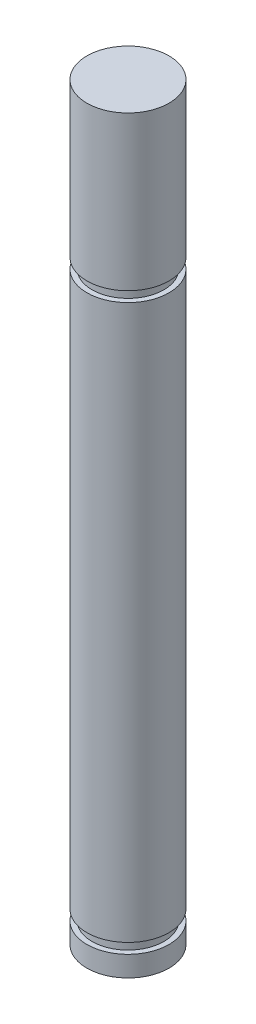
ISO-10303-21;
HEADER;
FILE_DESCRIPTION(('STEP AP214'),'2;1');
FILE_NAME('part.step','',(''),(''),'','','');
FILE_SCHEMA(('AUTOMOTIVE_DESIGN { 1 0 10303 214 1 1 1 1 }'));
ENDSEC;
DATA;
#1=APPLICATION_CONTEXT('core data for automotive mechanical design processes');
#2=APPLICATION_PROTOCOL_DEFINITION('international standard','automotive_design',2000,#1);
#3=PRODUCT_CONTEXT('',#1,'mechanical');
#4=PRODUCT('Part','Part','',(#3));
#5=PRODUCT_RELATED_PRODUCT_CATEGORY('part','',(#4));
#6=PRODUCT_DEFINITION_FORMATION('','',#4);
#7=PRODUCT_DEFINITION_CONTEXT('part definition',#1,'design');
#8=PRODUCT_DEFINITION('design','',#6,#7);
#9=PRODUCT_DEFINITION_SHAPE('','',#8);
#10=(LENGTH_UNIT() NAMED_UNIT(*) SI_UNIT(.MILLI.,.METRE.));
#11=(NAMED_UNIT(*) PLANE_ANGLE_UNIT() SI_UNIT($,.RADIAN.));
#12=(NAMED_UNIT(*) SI_UNIT($,.STERADIAN.) SOLID_ANGLE_UNIT());
#13=UNCERTAINTY_MEASURE_WITH_UNIT(LENGTH_MEASURE(1.E-05),#10,'distance_accuracy_value','');
#14=(GEOMETRIC_REPRESENTATION_CONTEXT(3) GLOBAL_UNCERTAINTY_ASSIGNED_CONTEXT((#13)) GLOBAL_UNIT_ASSIGNED_CONTEXT((#10,
#11,#12)) REPRESENTATION_CONTEXT('',''));
#15=CARTESIAN_POINT('',(0.,0.,0.));
#16=DIRECTION('',(0.,0.,1.));
#17=DIRECTION('',(1.,0.,0.));
#18=AXIS2_PLACEMENT_3D('',#15,#16,#17);
#19=CARTESIAN_POINT('',(0.,73.,0.));
#20=DIRECTION('',(0.,-1.,0.));
#21=DIRECTION('',(0.,0.,-1.));
#22=AXIS2_PLACEMENT_3D('',#19,#20,#21);
#23=CYLINDRICAL_SURFACE('',#22,4.);
#24=CARTESIAN_POINT('',(0.,58.,0.));
#25=DIRECTION('',(0.,1.,0.));
#26=DIRECTION('',(0.,0.,1.));
#27=AXIS2_PLACEMENT_3D('',#24,#25,#26);
#28=CIRCLE('',#27,4.);
#29=CARTESIAN_POINT('',(0.,58.,4.));
#30=VERTEX_POINT('',#29);
#31=EDGE_CURVE('E56',#30,#30,#28,.T.);
#32=ORIENTED_EDGE('',*,*,#31,.T.);
#33=EDGE_LOOP('',(#32));
#34=FACE_BOUND('',#33,.T.);
#35=CARTESIAN_POINT('',(0.,73.,0.));
#36=DIRECTION('',(0.,1.,0.));
#37=DIRECTION('',(0.,0.,1.));
#38=AXIS2_PLACEMENT_3D('',#35,#36,#37);
#39=CIRCLE('',#38,4.);
#40=CARTESIAN_POINT('',(0.,73.,4.));
#41=VERTEX_POINT('',#40);
#42=EDGE_CURVE('E10',#41,#41,#39,.T.);
#43=ORIENTED_EDGE('',*,*,#42,.F.);
#44=EDGE_LOOP('',(#43));
#45=FACE_BOUND('',#44,.T.);
#46=ADVANCED_FACE('F43',(#34,#45),#23,.T.);
#47=CARTESIAN_POINT('',(0.,73.,0.));
#48=DIRECTION('',(0.,1.,0.));
#49=DIRECTION('',(0.,0.,1.));
#50=AXIS2_PLACEMENT_3D('',#47,#48,#49);
#51=PLANE('',#50);
#52=ORIENTED_EDGE('',*,*,#42,.T.);
#53=EDGE_LOOP('',(#52));
#54=FACE_BOUND('',#53,.T.);
#55=ADVANCED_FACE('F138',(#54),#51,.T.);
#56=CARTESIAN_POINT('',(-3.5,58.,0.));
#57=DIRECTION('',(0.,1.,0.));
#58=DIRECTION('',(0.,0.,1.));
#59=AXIS2_PLACEMENT_3D('',#56,#57,#58);
#60=PLANE('',#59);
#61=ORIENTED_EDGE('',*,*,#31,.F.);
#62=EDGE_LOOP('',(#61));
#63=FACE_BOUND('',#62,.T.);
#64=CARTESIAN_POINT('',(0.,58.,0.));
#65=DIRECTION('',(0.,1.,0.));
#66=DIRECTION('',(0.,0.,1.));
#67=AXIS2_PLACEMENT_3D('',#64,#65,#66);
#68=CIRCLE('',#67,3.5);
#69=CARTESIAN_POINT('',(0.,58.,3.5));
#70=VERTEX_POINT('',#69);
#71=EDGE_CURVE('E62',#70,#70,#68,.T.);
#72=ORIENTED_EDGE('',*,*,#71,.T.);
#73=EDGE_LOOP('',(#72));
#74=FACE_BOUND('',#73,.T.);
#75=ADVANCED_FACE('F90',(#63,#74),#60,.F.);
#76=CARTESIAN_POINT('',(-4.,57.,0.));
#77=DIRECTION('',(0.,-1.,0.));
#78=DIRECTION('',(0.,0.,-1.));
#79=AXIS2_PLACEMENT_3D('',#76,#77,#78);
#80=PLANE('',#79);
#81=CARTESIAN_POINT('',(0.,57.,0.));
#82=DIRECTION('',(0.,1.,0.));
#83=DIRECTION('',(0.,0.,1.));
#84=AXIS2_PLACEMENT_3D('',#81,#82,#83);
#85=CIRCLE('',#84,3.5);
#86=CARTESIAN_POINT('',(0.,57.,3.5));
#87=VERTEX_POINT('',#86);
#88=EDGE_CURVE('E82',#87,#87,#85,.T.);
#89=ORIENTED_EDGE('',*,*,#88,.F.);
#90=EDGE_LOOP('',(#89));
#91=FACE_BOUND('',#90,.T.);
#92=CARTESIAN_POINT('',(0.,57.,0.));
#93=DIRECTION('',(0.,1.,0.));
#94=DIRECTION('',(0.,0.,1.));
#95=AXIS2_PLACEMENT_3D('',#92,#93,#94);
#96=CIRCLE('',#95,4.);
#97=CARTESIAN_POINT('',(0.,57.,4.));
#98=VERTEX_POINT('',#97);
#99=EDGE_CURVE('E78',#98,#98,#96,.T.);
#100=ORIENTED_EDGE('',*,*,#99,.T.);
#101=EDGE_LOOP('',(#100));
#102=FACE_BOUND('',#101,.T.);
#103=ADVANCED_FACE('F95',(#91,#102),#80,.F.);
#104=CARTESIAN_POINT('',(0.,73.,0.));
#105=DIRECTION('',(0.,1.,0.));
#106=DIRECTION('',(0.,0.,1.));
#107=AXIS2_PLACEMENT_3D('',#104,#105,#106);
#108=CYLINDRICAL_SURFACE('',#107,3.5);
#109=ORIENTED_EDGE('',*,*,#71,.F.);
#110=EDGE_LOOP('',(#109));
#111=FACE_BOUND('',#110,.T.);
#112=ORIENTED_EDGE('',*,*,#88,.T.);
#113=EDGE_LOOP('',(#112));
#114=FACE_BOUND('',#113,.T.);
#115=ADVANCED_FACE('F92',(#111,#114),#108,.T.);
#116=ORIENTED_EDGE('',*,*,#99,.F.);
#117=EDGE_LOOP('',(#116));
#118=FACE_BOUND('',#117,.T.);
#119=CARTESIAN_POINT('',(0.,3.,0.));
#120=DIRECTION('',(0.,1.,0.));
#121=DIRECTION('',(0.,0.,1.));
#122=AXIS2_PLACEMENT_3D('',#119,#120,#121);
#123=CIRCLE('',#122,4.);
#124=CARTESIAN_POINT('',(0.,3.,4.));
#125=VERTEX_POINT('',#124);
#126=EDGE_CURVE('E63',#125,#125,#123,.T.);
#127=ORIENTED_EDGE('',*,*,#126,.T.);
#128=EDGE_LOOP('',(#127));
#129=FACE_BOUND('',#128,.T.);
#130=ADVANCED_FACE('F45',(#118,#129),#23,.T.);
#131=CARTESIAN_POINT('',(-3.5,2.,0.));
#132=DIRECTION('',(0.,-1.,0.));
#133=DIRECTION('',(0.,0.,-1.));
#134=AXIS2_PLACEMENT_3D('',#131,#132,#133);
#135=PLANE('',#134);
#136=CARTESIAN_POINT('',(0.,2.,0.));
#137=DIRECTION('',(0.,1.,0.));
#138=DIRECTION('',(0.,0.,1.));
#139=AXIS2_PLACEMENT_3D('',#136,#137,#138);
#140=CIRCLE('',#139,3.5);
#141=CARTESIAN_POINT('',(0.,2.,3.5));
#142=VERTEX_POINT('',#141);
#143=EDGE_CURVE('E71',#142,#142,#140,.T.);
#144=ORIENTED_EDGE('',*,*,#143,.F.);
#145=EDGE_LOOP('',(#144));
#146=FACE_BOUND('',#145,.T.);
#147=CARTESIAN_POINT('',(0.,2.,0.));
#148=DIRECTION('',(0.,1.,0.));
#149=DIRECTION('',(0.,0.,1.));
#150=AXIS2_PLACEMENT_3D('',#147,#148,#149);
#151=CIRCLE('',#150,4.);
#152=CARTESIAN_POINT('',(0.,2.,4.));
#153=VERTEX_POINT('',#152);
#154=EDGE_CURVE('E58',#153,#153,#151,.T.);
#155=ORIENTED_EDGE('',*,*,#154,.T.);
#156=EDGE_LOOP('',(#155));
#157=FACE_BOUND('',#156,.T.);
#158=ADVANCED_FACE('F106',(#146,#157),#135,.F.);
#159=CARTESIAN_POINT('',(-4.,3.,0.));
#160=DIRECTION('',(0.,1.,0.));
#161=DIRECTION('',(0.,0.,1.));
#162=AXIS2_PLACEMENT_3D('',#159,#160,#161);
#163=PLANE('',#162);
#164=ORIENTED_EDGE('',*,*,#126,.F.);
#165=EDGE_LOOP('',(#164));
#166=FACE_BOUND('',#165,.T.);
#167=CARTESIAN_POINT('',(0.,3.,0.));
#168=DIRECTION('',(0.,1.,0.));
#169=DIRECTION('',(0.,0.,1.));
#170=AXIS2_PLACEMENT_3D('',#167,#168,#169);
#171=CIRCLE('',#170,3.5);
#172=CARTESIAN_POINT('',(0.,3.,3.5));
#173=VERTEX_POINT('',#172);
#174=EDGE_CURVE('E67',#173,#173,#171,.T.);
#175=ORIENTED_EDGE('',*,*,#174,.T.);
#176=EDGE_LOOP('',(#175));
#177=FACE_BOUND('',#176,.T.);
#178=ADVANCED_FACE('F110',(#166,#177),#163,.F.);
#179=CARTESIAN_POINT('',(0.,73.,0.));
#180=DIRECTION('',(0.,1.,0.));
#181=DIRECTION('',(0.,0.,1.));
#182=AXIS2_PLACEMENT_3D('',#179,#180,#181);
#183=CYLINDRICAL_SURFACE('',#182,3.5);
#184=ORIENTED_EDGE('',*,*,#174,.F.);
#185=EDGE_LOOP('',(#184));
#186=FACE_BOUND('',#185,.T.);
#187=ORIENTED_EDGE('',*,*,#143,.T.);
#188=EDGE_LOOP('',(#187));
#189=FACE_BOUND('',#188,.T.);
#190=ADVANCED_FACE('F113',(#186,#189),#183,.T.);
#191=CARTESIAN_POINT('',(0.,0.,0.));
#192=DIRECTION('',(0.,1.,0.));
#193=DIRECTION('',(0.,0.,1.));
#194=AXIS2_PLACEMENT_3D('',#191,#192,#193);
#195=PLANE('',#194);
#196=CARTESIAN_POINT('',(0.,0.,0.));
#197=DIRECTION('',(0.,1.,0.));
#198=DIRECTION('',(0.,0.,1.));
#199=AXIS2_PLACEMENT_3D('',#196,#197,#198);
#200=CIRCLE('',#199,4.);
#201=CARTESIAN_POINT('',(0.,0.,4.));
#202=VERTEX_POINT('',#201);
#203=EDGE_CURVE('E47',#202,#202,#200,.T.);
#204=ORIENTED_EDGE('',*,*,#203,.F.);
#205=EDGE_LOOP('',(#204));
#206=FACE_BOUND('',#205,.T.);
#207=ADVANCED_FACE('F119',(#206),#195,.F.);
#208=ORIENTED_EDGE('',*,*,#154,.F.);
#209=EDGE_LOOP('',(#208));
#210=FACE_BOUND('',#209,.T.);
#211=ORIENTED_EDGE('',*,*,#203,.T.);
#212=EDGE_LOOP('',(#211));
#213=FACE_BOUND('',#212,.T.);
#214=ADVANCED_FACE('F107',(#210,#213),#23,.T.);
#215=CLOSED_SHELL('',(#46,#55,#75,#103,#115,#130,#158,#178,#190,#207,#214));
#216=MANIFOLD_SOLID_BREP('B2',#215);
#217=ADVANCED_BREP_SHAPE_REPRESENTATION('',(#18,#216),#14);
#218=SHAPE_DEFINITION_REPRESENTATION(#9,#217);
ENDSEC;
END-ISO-10303-21;
